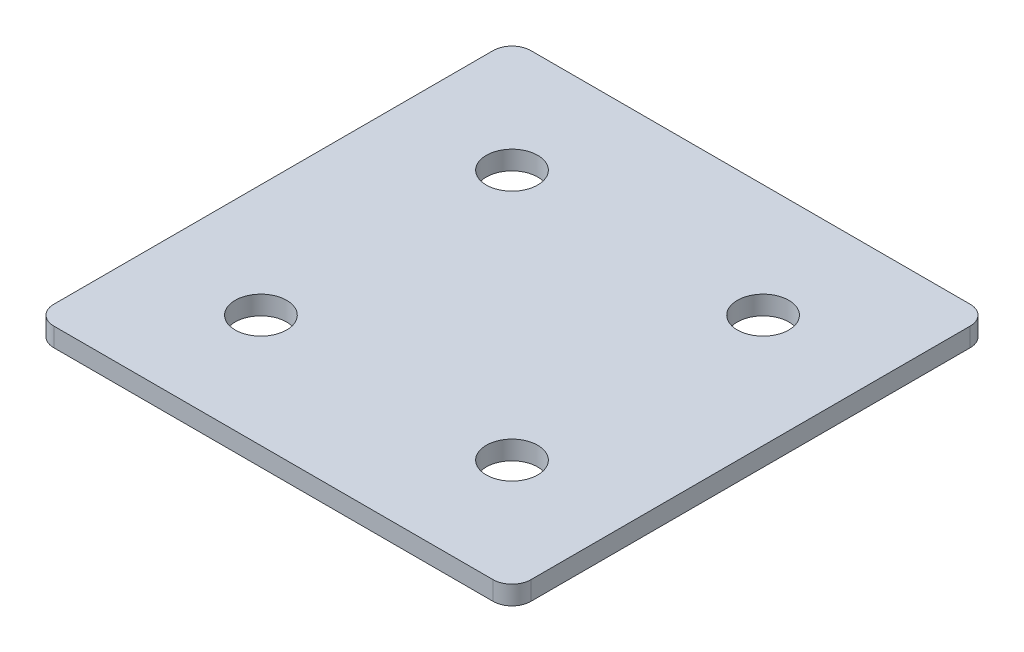
ISO-10303-21;
HEADER;
FILE_DESCRIPTION(('STEP AP214'),'2;1');
FILE_NAME('part.step','',(''),(''),'','','');
FILE_SCHEMA(('AUTOMOTIVE_DESIGN { 1 0 10303 214 1 1 1 1 }'));
ENDSEC;
DATA;
#1=APPLICATION_CONTEXT('core data for automotive mechanical design processes');
#2=APPLICATION_PROTOCOL_DEFINITION('international standard','automotive_design',2000,#1);
#3=PRODUCT_CONTEXT('',#1,'mechanical');
#4=PRODUCT('Part','Part','',(#3));
#5=PRODUCT_RELATED_PRODUCT_CATEGORY('part','',(#4));
#6=PRODUCT_DEFINITION_FORMATION('','',#4);
#7=PRODUCT_DEFINITION_CONTEXT('part definition',#1,'design');
#8=PRODUCT_DEFINITION('design','',#6,#7);
#9=PRODUCT_DEFINITION_SHAPE('','',#8);
#10=(LENGTH_UNIT() NAMED_UNIT(*) SI_UNIT(.MILLI.,.METRE.));
#11=(NAMED_UNIT(*) PLANE_ANGLE_UNIT() SI_UNIT($,.RADIAN.));
#12=(NAMED_UNIT(*) SI_UNIT($,.STERADIAN.) SOLID_ANGLE_UNIT());
#13=UNCERTAINTY_MEASURE_WITH_UNIT(LENGTH_MEASURE(1.E-05),#10,'distance_accuracy_value','');
#14=(GEOMETRIC_REPRESENTATION_CONTEXT(3) GLOBAL_UNCERTAINTY_ASSIGNED_CONTEXT((#13)) GLOBAL_UNIT_ASSIGNED_CONTEXT((#10,
#11,#12)) REPRESENTATION_CONTEXT('',''));
#15=CARTESIAN_POINT('',(0.,0.,0.));
#16=DIRECTION('',(0.,0.,1.));
#17=DIRECTION('',(1.,0.,0.));
#18=AXIS2_PLACEMENT_3D('',#15,#16,#17);
#19=CARTESIAN_POINT('',(-1.90802493216324,0.991348310229569,-20.5829184970594));
#20=DIRECTION('',(0.,-1.,0.));
#21=DIRECTION('',(0.,0.,-1.));
#22=AXIS2_PLACEMENT_3D('',#19,#20,#21);
#23=PLANE('',#22);
#24=CARTESIAN_POINT('',(18.0919750678368,0.991348310229569,19.4170815029406));
#25=DIRECTION('',(0.,1.,0.));
#26=DIRECTION('',(0.,0.,1.));
#27=AXIS2_PLACEMENT_3D('',#24,#25,#26);
#28=CIRCLE('',#27,4.1);
#29=CARTESIAN_POINT('',(18.0919750678368,0.991348310229569,23.5170815029406));
#30=VERTEX_POINT('',#29);
#31=EDGE_CURVE('E165',#30,#30,#28,.T.);
#32=ORIENTED_EDGE('',*,*,#31,.T.);
#33=EDGE_LOOP('',(#32));
#34=FACE_BOUND('',#33,.T.);
#35=CARTESIAN_POINT('',(-21.9080249321633,0.991348310229569,19.4170815029407));
#36=DIRECTION('',(0.,1.,0.));
#37=DIRECTION('',(0.,0.,1.));
#38=AXIS2_PLACEMENT_3D('',#35,#36,#37);
#39=CIRCLE('',#38,4.1);
#40=CARTESIAN_POINT('',(-21.9080249321633,0.991348310229569,23.5170815029406));
#41=VERTEX_POINT('',#40);
#42=EDGE_CURVE('E159',#41,#41,#39,.T.);
#43=ORIENTED_EDGE('',*,*,#42,.T.);
#44=EDGE_LOOP('',(#43));
#45=FACE_BOUND('',#44,.T.);
#46=CARTESIAN_POINT('',(18.0919750678368,0.991348310229569,-20.5829184970594));
#47=DIRECTION('',(0.,1.,0.));
#48=DIRECTION('',(0.,0.,1.));
#49=AXIS2_PLACEMENT_3D('',#46,#47,#48);
#50=CIRCLE('',#49,4.1);
#51=CARTESIAN_POINT('',(18.0919750678368,0.991348310229569,-16.4829184970594));
#52=VERTEX_POINT('',#51);
#53=EDGE_CURVE('E154',#52,#52,#50,.T.);
#54=ORIENTED_EDGE('',*,*,#53,.T.);
#55=EDGE_LOOP('',(#54));
#56=FACE_BOUND('',#55,.T.);
#57=CARTESIAN_POINT('',(-21.9080249321633,0.991348310229569,-20.5829184970594));
#58=DIRECTION('',(0.,1.,0.));
#59=DIRECTION('',(0.,0.,1.));
#60=AXIS2_PLACEMENT_3D('',#57,#58,#59);
#61=CIRCLE('',#60,4.1);
#62=CARTESIAN_POINT('',(-21.9080249321633,0.991348310229569,-16.4829184970594));
#63=VERTEX_POINT('',#62);
#64=EDGE_CURVE('E147',#63,#63,#61,.T.);
#65=ORIENTED_EDGE('',*,*,#64,.T.);
#66=EDGE_LOOP('',(#65));
#67=FACE_BOUND('',#66,.T.);
#68=DIRECTION('',(0.,0.,-1.));
#69=VECTOR('',#68,1.);
#70=CARTESIAN_POINT('',(36.0919750678369,0.991348310229569,37.4170815029406));
#71=LINE('',#70,#69);
#72=CARTESIAN_POINT('',(36.0919750678369,0.991348310229569,34.4170815029406));
#73=VERTEX_POINT('',#72);
#74=CARTESIAN_POINT('',(36.0919750678369,0.991348310229569,-35.5829184970594));
#75=VERTEX_POINT('',#74);
#76=EDGE_CURVE('E106',#73,#75,#71,.T.);
#77=ORIENTED_EDGE('',*,*,#76,.F.);
#78=CARTESIAN_POINT('',(33.0919750678369,0.991348310229569,34.4170815029406));
#79=DIRECTION('',(0.,-1.,0.));
#80=DIRECTION('',(0.,0.,-1.));
#81=AXIS2_PLACEMENT_3D('',#78,#79,#80);
#82=CIRCLE('',#81,3.);
#83=CARTESIAN_POINT('',(33.0919750678369,0.991348310229569,37.4170815029406));
#84=VERTEX_POINT('',#83);
#85=EDGE_CURVE('E128',#73,#84,#82,.T.);
#86=ORIENTED_EDGE('',*,*,#85,.T.);
#87=DIRECTION('',(1.,0.,0.));
#88=VECTOR('',#87,1.);
#89=CARTESIAN_POINT('',(-39.9080249321634,0.991348310229569,37.4170815029406));
#90=LINE('',#89,#88);
#91=CARTESIAN_POINT('',(-36.9080249321634,0.991348310229569,37.4170815029406));
#92=VERTEX_POINT('',#91);
#93=EDGE_CURVE('E110',#92,#84,#90,.T.);
#94=ORIENTED_EDGE('',*,*,#93,.F.);
#95=CARTESIAN_POINT('',(-36.9080249321634,0.991348310229569,34.4170815029406));
#96=DIRECTION('',(0.,-1.,0.));
#97=DIRECTION('',(0.,0.,-1.));
#98=AXIS2_PLACEMENT_3D('',#95,#96,#97);
#99=CIRCLE('',#98,3.);
#100=CARTESIAN_POINT('',(-39.9080249321634,0.991348310229569,34.4170815029406));
#101=VERTEX_POINT('',#100);
#102=EDGE_CURVE('E105',#92,#101,#99,.T.);
#103=ORIENTED_EDGE('',*,*,#102,.T.);
#104=DIRECTION('',(0.,0.,1.));
#105=VECTOR('',#104,1.);
#106=CARTESIAN_POINT('',(-39.9080249321634,0.991348310229569,-38.5829184970594));
#107=LINE('',#106,#105);
#108=CARTESIAN_POINT('',(-39.9080249321634,0.991348310229569,-35.5829184970594));
#109=VERTEX_POINT('',#108);
#110=EDGE_CURVE('E137',#109,#101,#107,.T.);
#111=ORIENTED_EDGE('',*,*,#110,.F.);
#112=CARTESIAN_POINT('',(-36.9080249321634,0.991348310229569,-35.5829184970594));
#113=DIRECTION('',(0.,-1.,0.));
#114=DIRECTION('',(0.,0.,-1.));
#115=AXIS2_PLACEMENT_3D('',#112,#113,#114);
#116=CIRCLE('',#115,3.);
#117=CARTESIAN_POINT('',(-36.9080249321634,0.991348310229569,-38.5829184970594));
#118=VERTEX_POINT('',#117);
#119=EDGE_CURVE('E31',#109,#118,#116,.T.);
#120=ORIENTED_EDGE('',*,*,#119,.T.);
#121=DIRECTION('',(-1.,0.,0.));
#122=VECTOR('',#121,1.);
#123=CARTESIAN_POINT('',(36.0919750678369,0.991348310229569,-38.5829184970594));
#124=LINE('',#123,#122);
#125=CARTESIAN_POINT('',(33.0919750678369,0.991348310229569,-38.5829184970594));
#126=VERTEX_POINT('',#125);
#127=EDGE_CURVE('E138',#126,#118,#124,.T.);
#128=ORIENTED_EDGE('',*,*,#127,.F.);
#129=CARTESIAN_POINT('',(33.0919750678369,0.991348310229569,-35.5829184970594));
#130=DIRECTION('',(0.,-1.,0.));
#131=DIRECTION('',(0.,0.,-1.));
#132=AXIS2_PLACEMENT_3D('',#129,#130,#131);
#133=CIRCLE('',#132,3.);
#134=EDGE_CURVE('E126',#126,#75,#133,.T.);
#135=ORIENTED_EDGE('',*,*,#134,.T.);
#136=EDGE_LOOP('',(#77,#86,#94,#103,#111,#120,#128,#135));
#137=FACE_BOUND('',#136,.T.);
#138=ADVANCED_FACE('F16',(#34,#45,#56,#67,#137),#23,.T.);
#139=CARTESIAN_POINT('',(36.0919750678369,0.991348310229569,-38.5829184970594));
#140=DIRECTION('',(0.,0.,-1.));
#141=DIRECTION('',(-1.,0.,0.));
#142=AXIS2_PLACEMENT_3D('',#139,#140,#141);
#143=PLANE('',#142);
#144=DIRECTION('',(-1.,0.,0.));
#145=VECTOR('',#144,1.);
#146=CARTESIAN_POINT('',(36.0919750678369,3.99134831022957,-38.5829184970594));
#147=LINE('',#146,#145);
#148=CARTESIAN_POINT('',(33.0919750678369,3.99134831022957,-38.5829184970594));
#149=VERTEX_POINT('',#148);
#150=CARTESIAN_POINT('',(-36.9080249321634,3.99134831022957,-38.5829184970594));
#151=VERTEX_POINT('',#150);
#152=EDGE_CURVE('E144',#149,#151,#147,.T.);
#153=ORIENTED_EDGE('',*,*,#152,.F.);
#154=DIRECTION('',(0.,1.,0.));
#155=VECTOR('',#154,1.);
#156=CARTESIAN_POINT('',(33.0919750678369,0.991348310229569,-38.5829184970594));
#157=LINE('',#156,#155);
#158=EDGE_CURVE('E38',#149,#126,#157,.F.);
#159=ORIENTED_EDGE('',*,*,#158,.T.);
#160=ORIENTED_EDGE('',*,*,#127,.T.);
#161=DIRECTION('',(0.,1.,0.));
#162=VECTOR('',#161,1.);
#163=CARTESIAN_POINT('',(-36.9080249321634,0.991348310229569,-38.5829184970594));
#164=LINE('',#163,#162);
#165=EDGE_CURVE('E130',#118,#151,#164,.T.);
#166=ORIENTED_EDGE('',*,*,#165,.T.);
#167=EDGE_LOOP('',(#153,#159,#160,#166));
#168=FACE_BOUND('',#167,.T.);
#169=ADVANCED_FACE('F206',(#168),#143,.T.);
#170=CARTESIAN_POINT('',(36.0919750678369,0.991348310229569,37.4170815029406));
#171=DIRECTION('',(1.,0.,0.));
#172=DIRECTION('',(0.,0.,-1.));
#173=AXIS2_PLACEMENT_3D('',#170,#171,#172);
#174=PLANE('',#173);
#175=DIRECTION('',(0.,0.,-1.));
#176=VECTOR('',#175,1.);
#177=CARTESIAN_POINT('',(36.0919750678369,3.99134831022957,37.4170815029406));
#178=LINE('',#177,#176);
#179=CARTESIAN_POINT('',(36.0919750678369,3.99134831022957,34.4170815029406));
#180=VERTEX_POINT('',#179);
#181=CARTESIAN_POINT('',(36.0919750678369,3.99134831022957,-35.5829184970594));
#182=VERTEX_POINT('',#181);
#183=EDGE_CURVE('E102',#180,#182,#178,.T.);
#184=ORIENTED_EDGE('',*,*,#183,.F.);
#185=DIRECTION('',(0.,1.,0.));
#186=VECTOR('',#185,1.);
#187=CARTESIAN_POINT('',(36.0919750678369,0.991348310229569,34.4170815029406));
#188=LINE('',#187,#186);
#189=EDGE_CURVE('E122',#180,#73,#188,.F.);
#190=ORIENTED_EDGE('',*,*,#189,.T.);
#191=ORIENTED_EDGE('',*,*,#76,.T.);
#192=DIRECTION('',(0.,1.,0.));
#193=VECTOR('',#192,1.);
#194=CARTESIAN_POINT('',(36.0919750678369,0.991348310229569,-35.5829184970594));
#195=LINE('',#194,#193);
#196=EDGE_CURVE('E119',#75,#182,#195,.T.);
#197=ORIENTED_EDGE('',*,*,#196,.T.);
#198=EDGE_LOOP('',(#184,#190,#191,#197));
#199=FACE_BOUND('',#198,.T.);
#200=ADVANCED_FACE('F211',(#199),#174,.T.);
#201=CARTESIAN_POINT('',(-39.9080249321634,0.991348310229569,37.4170815029406));
#202=DIRECTION('',(0.,0.,1.));
#203=DIRECTION('',(1.,0.,0.));
#204=AXIS2_PLACEMENT_3D('',#201,#202,#203);
#205=PLANE('',#204);
#206=ORIENTED_EDGE('',*,*,#93,.T.);
#207=DIRECTION('',(0.,1.,0.));
#208=VECTOR('',#207,1.);
#209=CARTESIAN_POINT('',(33.0919750678369,0.991348310229569,37.4170815029406));
#210=LINE('',#209,#208);
#211=CARTESIAN_POINT('',(33.0919750678369,3.99134831022957,37.4170815029406));
#212=VERTEX_POINT('',#211);
#213=EDGE_CURVE('E93',#84,#212,#210,.T.);
#214=ORIENTED_EDGE('',*,*,#213,.T.);
#215=DIRECTION('',(1.,0.,0.));
#216=VECTOR('',#215,1.);
#217=CARTESIAN_POINT('',(-39.9080249321634,3.99134831022957,37.4170815029406));
#218=LINE('',#217,#216);
#219=CARTESIAN_POINT('',(-36.9080249321634,3.99134831022957,37.4170815029406));
#220=VERTEX_POINT('',#219);
#221=EDGE_CURVE('E85',#220,#212,#218,.T.);
#222=ORIENTED_EDGE('',*,*,#221,.F.);
#223=DIRECTION('',(0.,1.,0.));
#224=VECTOR('',#223,1.);
#225=CARTESIAN_POINT('',(-36.9080249321634,0.991348310229569,37.4170815029406));
#226=LINE('',#225,#224);
#227=EDGE_CURVE('E99',#220,#92,#226,.F.);
#228=ORIENTED_EDGE('',*,*,#227,.T.);
#229=EDGE_LOOP('',(#206,#214,#222,#228));
#230=FACE_BOUND('',#229,.T.);
#231=ADVANCED_FACE('F98',(#230),#205,.T.);
#232=CARTESIAN_POINT('',(-39.9080249321634,0.991348310229569,-38.5829184970594));
#233=DIRECTION('',(-1.,0.,0.));
#234=DIRECTION('',(0.,0.,1.));
#235=AXIS2_PLACEMENT_3D('',#232,#233,#234);
#236=PLANE('',#235);
#237=DIRECTION('',(0.,0.,1.));
#238=VECTOR('',#237,1.);
#239=CARTESIAN_POINT('',(-39.9080249321634,3.99134831022957,-38.5829184970594));
#240=LINE('',#239,#238);
#241=CARTESIAN_POINT('',(-39.9080249321634,3.99134831022957,-35.5829184970594));
#242=VERTEX_POINT('',#241);
#243=CARTESIAN_POINT('',(-39.9080249321634,3.99134831022957,34.4170815029406));
#244=VERTEX_POINT('',#243);
#245=EDGE_CURVE('E87',#242,#244,#240,.T.);
#246=ORIENTED_EDGE('',*,*,#245,.F.);
#247=DIRECTION('',(0.,1.,0.));
#248=VECTOR('',#247,1.);
#249=CARTESIAN_POINT('',(-39.9080249321634,0.991348310229569,-35.5829184970594));
#250=LINE('',#249,#248);
#251=EDGE_CURVE('E10',#242,#109,#250,.F.);
#252=ORIENTED_EDGE('',*,*,#251,.T.);
#253=ORIENTED_EDGE('',*,*,#110,.T.);
#254=DIRECTION('',(0.,1.,0.));
#255=VECTOR('',#254,1.);
#256=CARTESIAN_POINT('',(-39.9080249321634,0.991348310229569,34.4170815029406));
#257=LINE('',#256,#255);
#258=EDGE_CURVE('E24',#101,#244,#257,.T.);
#259=ORIENTED_EDGE('',*,*,#258,.T.);
#260=EDGE_LOOP('',(#246,#252,#253,#259));
#261=FACE_BOUND('',#260,.T.);
#262=ADVANCED_FACE('F135',(#261),#236,.T.);
#263=CARTESIAN_POINT('',(-1.90802493216324,3.99134831022957,-20.5829184970594));
#264=DIRECTION('',(0.,-1.,0.));
#265=DIRECTION('',(0.,0.,-1.));
#266=AXIS2_PLACEMENT_3D('',#263,#264,#265);
#267=PLANE('',#266);
#268=CARTESIAN_POINT('',(18.0919750678368,3.99134831022957,19.4170815029406));
#269=DIRECTION('',(0.,1.,0.));
#270=DIRECTION('',(0.,0.,1.));
#271=AXIS2_PLACEMENT_3D('',#268,#269,#270);
#272=CIRCLE('',#271,4.1);
#273=CARTESIAN_POINT('',(18.0919750678368,3.99134831022957,23.5170815029406));
#274=VERTEX_POINT('',#273);
#275=EDGE_CURVE('E168',#274,#274,#272,.T.);
#276=ORIENTED_EDGE('',*,*,#275,.F.);
#277=EDGE_LOOP('',(#276));
#278=FACE_BOUND('',#277,.T.);
#279=CARTESIAN_POINT('',(-21.9080249321633,3.99134831022957,19.4170815029407));
#280=DIRECTION('',(0.,1.,0.));
#281=DIRECTION('',(0.,0.,1.));
#282=AXIS2_PLACEMENT_3D('',#279,#280,#281);
#283=CIRCLE('',#282,4.1);
#284=CARTESIAN_POINT('',(-21.9080249321633,3.99134831022957,23.5170815029406));
#285=VERTEX_POINT('',#284);
#286=EDGE_CURVE('E162',#285,#285,#283,.T.);
#287=ORIENTED_EDGE('',*,*,#286,.F.);
#288=EDGE_LOOP('',(#287));
#289=FACE_BOUND('',#288,.T.);
#290=CARTESIAN_POINT('',(18.0919750678368,3.99134831022957,-20.5829184970594));
#291=DIRECTION('',(0.,1.,0.));
#292=DIRECTION('',(0.,0.,1.));
#293=AXIS2_PLACEMENT_3D('',#290,#291,#292);
#294=CIRCLE('',#293,4.1);
#295=CARTESIAN_POINT('',(18.0919750678368,3.99134831022957,-16.4829184970594));
#296=VERTEX_POINT('',#295);
#297=EDGE_CURVE('E156',#296,#296,#294,.T.);
#298=ORIENTED_EDGE('',*,*,#297,.F.);
#299=EDGE_LOOP('',(#298));
#300=FACE_BOUND('',#299,.T.);
#301=CARTESIAN_POINT('',(-21.9080249321633,3.99134831022957,-20.5829184970594));
#302=DIRECTION('',(0.,1.,0.));
#303=DIRECTION('',(0.,0.,1.));
#304=AXIS2_PLACEMENT_3D('',#301,#302,#303);
#305=CIRCLE('',#304,4.1);
#306=CARTESIAN_POINT('',(-21.9080249321633,3.99134831022957,-16.4829184970594));
#307=VERTEX_POINT('',#306);
#308=EDGE_CURVE('E149',#307,#307,#305,.T.);
#309=ORIENTED_EDGE('',*,*,#308,.F.);
#310=EDGE_LOOP('',(#309));
#311=FACE_BOUND('',#310,.T.);
#312=ORIENTED_EDGE('',*,*,#221,.T.);
#313=CARTESIAN_POINT('',(33.0919750678369,3.99134831022957,34.4170815029406));
#314=DIRECTION('',(0.,-1.,0.));
#315=DIRECTION('',(0.,0.,-1.));
#316=AXIS2_PLACEMENT_3D('',#313,#314,#315);
#317=CIRCLE('',#316,3.);
#318=EDGE_CURVE('E117',#212,#180,#317,.F.);
#319=ORIENTED_EDGE('',*,*,#318,.T.);
#320=ORIENTED_EDGE('',*,*,#183,.T.);
#321=CARTESIAN_POINT('',(33.0919750678369,3.99134831022957,-35.5829184970594));
#322=DIRECTION('',(0.,-1.,0.));
#323=DIRECTION('',(0.,0.,-1.));
#324=AXIS2_PLACEMENT_3D('',#321,#322,#323);
#325=CIRCLE('',#324,3.);
#326=EDGE_CURVE('E115',#182,#149,#325,.F.);
#327=ORIENTED_EDGE('',*,*,#326,.T.);
#328=ORIENTED_EDGE('',*,*,#152,.T.);
#329=CARTESIAN_POINT('',(-36.9080249321634,3.99134831022957,-35.5829184970594));
#330=DIRECTION('',(0.,-1.,0.));
#331=DIRECTION('',(0.,0.,-1.));
#332=AXIS2_PLACEMENT_3D('',#329,#330,#331);
#333=CIRCLE('',#332,3.);
#334=EDGE_CURVE('E92',#151,#242,#333,.F.);
#335=ORIENTED_EDGE('',*,*,#334,.T.);
#336=ORIENTED_EDGE('',*,*,#245,.T.);
#337=CARTESIAN_POINT('',(-36.9080249321634,3.99134831022957,34.4170815029406));
#338=DIRECTION('',(0.,-1.,0.));
#339=DIRECTION('',(0.,0.,-1.));
#340=AXIS2_PLACEMENT_3D('',#337,#338,#339);
#341=CIRCLE('',#340,3.);
#342=EDGE_CURVE('E82',#244,#220,#341,.F.);
#343=ORIENTED_EDGE('',*,*,#342,.T.);
#344=EDGE_LOOP('',(#312,#319,#320,#327,#328,#335,#336,#343));
#345=FACE_BOUND('',#344,.T.);
#346=ADVANCED_FACE('F84',(#278,#289,#300,#311,#345),#267,.F.);
#347=CARTESIAN_POINT('',(-21.9080249321633,0.991348310229569,-20.5829184970594));
#348=DIRECTION('',(0.,1.,0.));
#349=DIRECTION('',(0.,0.,1.));
#350=AXIS2_PLACEMENT_3D('',#347,#348,#349);
#351=CYLINDRICAL_SURFACE('',#350,4.1);
#352=ORIENTED_EDGE('',*,*,#64,.F.);
#353=EDGE_LOOP('',(#352));
#354=FACE_BOUND('',#353,.T.);
#355=ORIENTED_EDGE('',*,*,#308,.T.);
#356=EDGE_LOOP('',(#355));
#357=FACE_BOUND('',#356,.T.);
#358=ADVANCED_FACE('F186',(#354,#357),#351,.F.);
#359=CARTESIAN_POINT('',(18.0919750678368,0.991348310229569,-20.5829184970594));
#360=DIRECTION('',(0.,1.,0.));
#361=DIRECTION('',(0.,0.,1.));
#362=AXIS2_PLACEMENT_3D('',#359,#360,#361);
#363=CYLINDRICAL_SURFACE('',#362,4.1);
#364=ORIENTED_EDGE('',*,*,#53,.F.);
#365=EDGE_LOOP('',(#364));
#366=FACE_BOUND('',#365,.T.);
#367=ORIENTED_EDGE('',*,*,#297,.T.);
#368=EDGE_LOOP('',(#367));
#369=FACE_BOUND('',#368,.T.);
#370=ADVANCED_FACE('F195',(#366,#369),#363,.F.);
#371=CARTESIAN_POINT('',(-21.9080249321633,0.991348310229569,19.4170815029407));
#372=DIRECTION('',(0.,1.,0.));
#373=DIRECTION('',(0.,0.,1.));
#374=AXIS2_PLACEMENT_3D('',#371,#372,#373);
#375=CYLINDRICAL_SURFACE('',#374,4.1);
#376=ORIENTED_EDGE('',*,*,#42,.F.);
#377=EDGE_LOOP('',(#376));
#378=FACE_BOUND('',#377,.T.);
#379=ORIENTED_EDGE('',*,*,#286,.T.);
#380=EDGE_LOOP('',(#379));
#381=FACE_BOUND('',#380,.T.);
#382=ADVANCED_FACE('F180',(#378,#381),#375,.F.);
#383=CARTESIAN_POINT('',(18.0919750678368,0.991348310229569,19.4170815029406));
#384=DIRECTION('',(0.,1.,0.));
#385=DIRECTION('',(0.,0.,1.));
#386=AXIS2_PLACEMENT_3D('',#383,#384,#385);
#387=CYLINDRICAL_SURFACE('',#386,4.1);
#388=ORIENTED_EDGE('',*,*,#31,.F.);
#389=EDGE_LOOP('',(#388));
#390=FACE_BOUND('',#389,.T.);
#391=ORIENTED_EDGE('',*,*,#275,.T.);
#392=EDGE_LOOP('',(#391));
#393=FACE_BOUND('',#392,.T.);
#394=ADVANCED_FACE('F176',(#390,#393),#387,.F.);
#395=CARTESIAN_POINT('',(33.0919750678369,0.991348310229569,34.4170815029406));
#396=DIRECTION('',(0.,1.,0.));
#397=DIRECTION('',(0.,0.,1.));
#398=AXIS2_PLACEMENT_3D('',#395,#396,#397);
#399=CYLINDRICAL_SURFACE('',#398,3.);
#400=ORIENTED_EDGE('',*,*,#85,.F.);
#401=ORIENTED_EDGE('',*,*,#189,.F.);
#402=ORIENTED_EDGE('',*,*,#318,.F.);
#403=ORIENTED_EDGE('',*,*,#213,.F.);
#404=EDGE_LOOP('',(#400,#401,#402,#403));
#405=FACE_BOUND('',#404,.T.);
#406=ADVANCED_FACE('F179',(#405),#399,.T.);
#407=CARTESIAN_POINT('',(33.0919750678369,0.991348310229569,-35.5829184970594));
#408=DIRECTION('',(0.,1.,0.));
#409=DIRECTION('',(0.,0.,1.));
#410=AXIS2_PLACEMENT_3D('',#407,#408,#409);
#411=CYLINDRICAL_SURFACE('',#410,3.);
#412=ORIENTED_EDGE('',*,*,#134,.F.);
#413=ORIENTED_EDGE('',*,*,#158,.F.);
#414=ORIENTED_EDGE('',*,*,#326,.F.);
#415=ORIENTED_EDGE('',*,*,#196,.F.);
#416=EDGE_LOOP('',(#412,#413,#414,#415));
#417=FACE_BOUND('',#416,.T.);
#418=ADVANCED_FACE('F216',(#417),#411,.T.);
#419=CARTESIAN_POINT('',(-36.9080249321634,0.991348310229569,-35.5829184970594));
#420=DIRECTION('',(0.,1.,0.));
#421=DIRECTION('',(0.,0.,1.));
#422=AXIS2_PLACEMENT_3D('',#419,#420,#421);
#423=CYLINDRICAL_SURFACE('',#422,3.);
#424=ORIENTED_EDGE('',*,*,#119,.F.);
#425=ORIENTED_EDGE('',*,*,#251,.F.);
#426=ORIENTED_EDGE('',*,*,#334,.F.);
#427=ORIENTED_EDGE('',*,*,#165,.F.);
#428=EDGE_LOOP('',(#424,#425,#426,#427));
#429=FACE_BOUND('',#428,.T.);
#430=ADVANCED_FACE('F219',(#429),#423,.T.);
#431=CARTESIAN_POINT('',(-36.9080249321634,0.991348310229569,34.4170815029406));
#432=DIRECTION('',(0.,1.,0.));
#433=DIRECTION('',(0.,0.,1.));
#434=AXIS2_PLACEMENT_3D('',#431,#432,#433);
#435=CYLINDRICAL_SURFACE('',#434,3.);
#436=ORIENTED_EDGE('',*,*,#102,.F.);
#437=ORIENTED_EDGE('',*,*,#227,.F.);
#438=ORIENTED_EDGE('',*,*,#342,.F.);
#439=ORIENTED_EDGE('',*,*,#258,.F.);
#440=EDGE_LOOP('',(#436,#437,#438,#439));
#441=FACE_BOUND('',#440,.T.);
#442=ADVANCED_FACE('F18',(#441),#435,.T.);
#443=CLOSED_SHELL('',(#138,#169,#200,#231,#262,#346,#358,#370,#382,#394,#406,#418,#430,#442));
#444=MANIFOLD_SOLID_BREP('B1',#443);
#445=ADVANCED_BREP_SHAPE_REPRESENTATION('',(#18,#444),#14);
#446=SHAPE_DEFINITION_REPRESENTATION(#9,#445);
ENDSEC;
END-ISO-10303-21;
